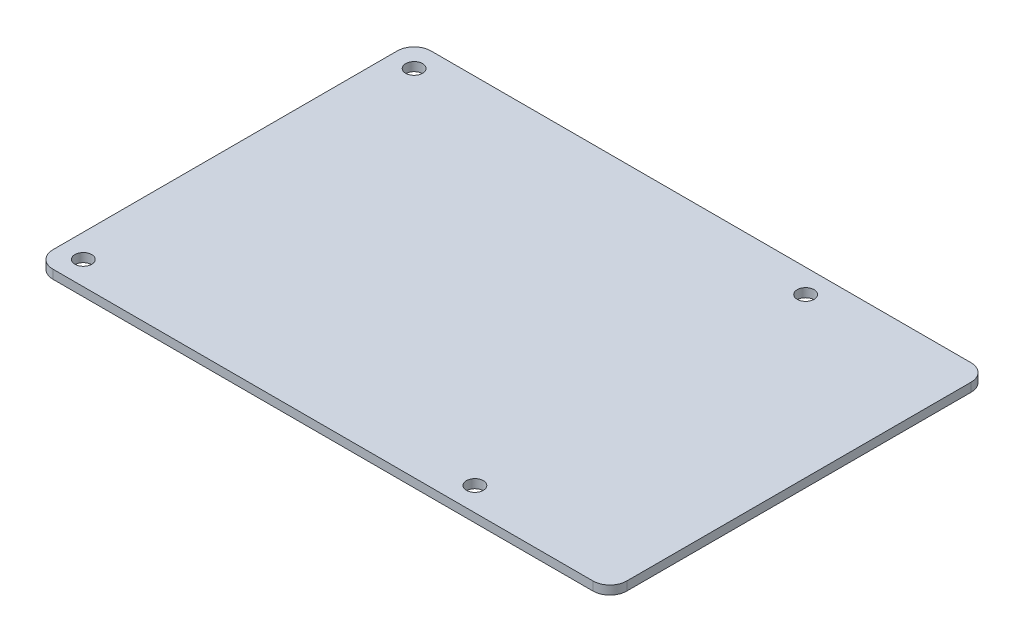
ISO-10303-21;
HEADER;
FILE_DESCRIPTION(('STEP AP214'),'2;1');
FILE_NAME('part.step','',(''),(''),'','','');
FILE_SCHEMA(('AUTOMOTIVE_DESIGN { 1 0 10303 214 1 1 1 1 }'));
ENDSEC;
DATA;
#1=APPLICATION_CONTEXT('core data for automotive mechanical design processes');
#2=APPLICATION_PROTOCOL_DEFINITION('international standard','automotive_design',2000,#1);
#3=PRODUCT_CONTEXT('',#1,'mechanical');
#4=PRODUCT('Part','Part','',(#3));
#5=PRODUCT_RELATED_PRODUCT_CATEGORY('part','',(#4));
#6=PRODUCT_DEFINITION_FORMATION('','',#4);
#7=PRODUCT_DEFINITION_CONTEXT('part definition',#1,'design');
#8=PRODUCT_DEFINITION('design','',#6,#7);
#9=PRODUCT_DEFINITION_SHAPE('','',#8);
#10=(LENGTH_UNIT() NAMED_UNIT(*) SI_UNIT(.MILLI.,.METRE.));
#11=(NAMED_UNIT(*) PLANE_ANGLE_UNIT() SI_UNIT($,.RADIAN.));
#12=(NAMED_UNIT(*) SI_UNIT($,.STERADIAN.) SOLID_ANGLE_UNIT());
#13=UNCERTAINTY_MEASURE_WITH_UNIT(LENGTH_MEASURE(1.E-05),#10,'distance_accuracy_value','');
#14=(GEOMETRIC_REPRESENTATION_CONTEXT(3) GLOBAL_UNCERTAINTY_ASSIGNED_CONTEXT((#13)) GLOBAL_UNIT_ASSIGNED_CONTEXT((#10,
#11,#12)) REPRESENTATION_CONTEXT('',''));
#15=CARTESIAN_POINT('',(0.,0.,0.));
#16=DIRECTION('',(0.,0.,1.));
#17=DIRECTION('',(1.,0.,0.));
#18=AXIS2_PLACEMENT_3D('',#15,#16,#17);
#19=CARTESIAN_POINT('',(39.9999999999725,0.,25.5000000000432));
#20=DIRECTION('',(0.,1.,0.));
#21=DIRECTION('',(0.,0.,1.));
#22=AXIS2_PLACEMENT_3D('',#19,#20,#21);
#23=PLANE('',#22);
#24=CARTESIAN_POINT('',(-40.0000000000275,0.,25.4999999999568));
#25=DIRECTION('',(0.,1.,0.));
#26=DIRECTION('',(0.,0.,1.));
#27=AXIS2_PLACEMENT_3D('',#24,#25,#26);
#28=CIRCLE('',#27,2.50000000000001);
#29=CARTESIAN_POINT('',(-40.0000000000302,0.,27.9999999999568));
#30=VERTEX_POINT('',#29);
#31=CARTESIAN_POINT('',(-42.5000000000275,0.,25.4999999999541));
#32=VERTEX_POINT('',#31);
#33=EDGE_CURVE('E143',#30,#32,#28,.F.);
#34=ORIENTED_EDGE('',*,*,#33,.F.);
#35=DIRECTION('',(1.,0.,1.07938831483967E-12));
#36=VECTOR('',#35,1.);
#37=CARTESIAN_POINT('',(-40.0000000000302,0.,27.9999999999568));
#38=LINE('',#37,#36);
#39=CARTESIAN_POINT('',(39.9999999999711,0.,28.0000000000432));
#40=VERTEX_POINT('',#39);
#41=EDGE_CURVE('E111',#40,#30,#38,.F.);
#42=ORIENTED_EDGE('',*,*,#41,.F.);
#43=CARTESIAN_POINT('',(39.9999999999725,0.,25.5000000000432));
#44=DIRECTION('',(0.,1.,0.));
#45=DIRECTION('',(0.,0.,1.));
#46=AXIS2_PLACEMENT_3D('',#43,#44,#45);
#47=CIRCLE('',#46,2.50000000000001);
#48=CARTESIAN_POINT('',(42.4999999999725,0.,25.5000000000459));
#49=VERTEX_POINT('',#48);
#50=EDGE_CURVE('E97',#49,#40,#47,.F.);
#51=ORIENTED_EDGE('',*,*,#50,.F.);
#52=DIRECTION('',(1.07920208717239E-12,0.,-1.));
#53=VECTOR('',#52,1.);
#54=CARTESIAN_POINT('',(42.4999999999725,0.,25.5000000000459));
#55=LINE('',#54,#53);
#56=CARTESIAN_POINT('',(42.5000000000275,0.,-25.4999999999541));
#57=VERTEX_POINT('',#56);
#58=EDGE_CURVE('E91',#57,#49,#55,.F.);
#59=ORIENTED_EDGE('',*,*,#58,.F.);
#60=CARTESIAN_POINT('',(40.0000000000275,0.,-25.4999999999568));
#61=DIRECTION('',(0.,1.,0.));
#62=DIRECTION('',(0.,0.,1.));
#63=AXIS2_PLACEMENT_3D('',#60,#61,#62);
#64=CIRCLE('',#63,2.5);
#65=CARTESIAN_POINT('',(40.0000000000302,0.,-27.9999999999568));
#66=VERTEX_POINT('',#65);
#67=EDGE_CURVE('E82',#66,#57,#64,.F.);
#68=ORIENTED_EDGE('',*,*,#67,.F.);
#69=DIRECTION('',(-1.,0.,-1.07908473823137E-12));
#70=VECTOR('',#69,1.);
#71=CARTESIAN_POINT('',(40.0000000000302,0.,-27.9999999999568));
#72=LINE('',#71,#70);
#73=CARTESIAN_POINT('',(-39.9999999999698,0.,-28.0000000000432));
#74=VERTEX_POINT('',#73);
#75=EDGE_CURVE('E77',#74,#66,#72,.F.);
#76=ORIENTED_EDGE('',*,*,#75,.F.);
#77=CARTESIAN_POINT('',(-39.9999999999725,0.,-25.5000000000431));
#78=DIRECTION('',(0.,1.,0.));
#79=DIRECTION('',(0.,0.,1.));
#80=AXIS2_PLACEMENT_3D('',#77,#78,#79);
#81=CIRCLE('',#80,2.5);
#82=CARTESIAN_POINT('',(-42.4999999999725,0.,-25.5000000000458));
#83=VERTEX_POINT('',#82);
#84=EDGE_CURVE('E145',#83,#74,#81,.F.);
#85=ORIENTED_EDGE('',*,*,#84,.F.);
#86=DIRECTION('',(-1.07933814391561E-12,0.,1.));
#87=VECTOR('',#86,1.);
#88=CARTESIAN_POINT('',(-42.4999999999725,0.,-25.5000000000458));
#89=LINE('',#88,#87);
#90=EDGE_CURVE('E115',#32,#83,#89,.F.);
#91=ORIENTED_EDGE('',*,*,#90,.F.);
#92=EDGE_LOOP('',(#34,#42,#51,#59,#68,#76,#85,#91));
#93=FACE_BOUND('',#92,.T.);
#94=CARTESIAN_POINT('',(19.000000000013,0.,-24.499999999993));
#95=DIRECTION('',(0.,1.,0.));
#96=DIRECTION('',(0.,0.,1.));
#97=AXIS2_PLACEMENT_3D('',#94,#95,#96);
#98=CIRCLE('',#97,1.24999999998654);
#99=CARTESIAN_POINT('',(19.000000000013,0.,-23.2500000000065));
#100=VERTEX_POINT('',#99);
#101=EDGE_CURVE('E101',#100,#100,#98,.F.);
#102=ORIENTED_EDGE('',*,*,#101,.T.);
#103=EDGE_LOOP('',(#102));
#104=FACE_BOUND('',#103,.T.);
#105=CARTESIAN_POINT('',(-38.999999999987,0.,-24.5000000000555));
#106=DIRECTION('',(0.,1.,0.));
#107=DIRECTION('',(0.,0.,1.));
#108=AXIS2_PLACEMENT_3D('',#105,#106,#107);
#109=CIRCLE('',#108,1.24999999998659);
#110=CARTESIAN_POINT('',(-38.999999999987,0.,-23.250000000069));
#111=VERTEX_POINT('',#110);
#112=EDGE_CURVE('E149',#111,#111,#109,.F.);
#113=ORIENTED_EDGE('',*,*,#112,.T.);
#114=EDGE_LOOP('',(#113));
#115=FACE_BOUND('',#114,.T.);
#116=CARTESIAN_POINT('',(-39.0000000000399,0.,24.4999999999304));
#117=DIRECTION('',(0.,1.,0.));
#118=DIRECTION('',(0.,0.,1.));
#119=AXIS2_PLACEMENT_3D('',#116,#117,#118);
#120=CIRCLE('',#119,1.24999999998655);
#121=CARTESIAN_POINT('',(-39.0000000000399,0.,25.7499999999169));
#122=VERTEX_POINT('',#121);
#123=EDGE_CURVE('E151',#122,#122,#120,.F.);
#124=ORIENTED_EDGE('',*,*,#123,.T.);
#125=EDGE_LOOP('',(#124));
#126=FACE_BOUND('',#125,.T.);
#127=CARTESIAN_POINT('',(18.9999999999601,0.,24.499999999993));
#128=DIRECTION('',(0.,1.,0.));
#129=DIRECTION('',(0.,0.,1.));
#130=AXIS2_PLACEMENT_3D('',#127,#128,#129);
#131=CIRCLE('',#130,1.24999999998654);
#132=CARTESIAN_POINT('',(18.9999999999601,0.,25.7499999999795));
#133=VERTEX_POINT('',#132);
#134=EDGE_CURVE('E19',#133,#133,#131,.F.);
#135=ORIENTED_EDGE('',*,*,#134,.T.);
#136=EDGE_LOOP('',(#135));
#137=FACE_BOUND('',#136,.T.);
#138=ADVANCED_FACE('F16',(#93,#104,#115,#126,#137),#23,.T.);
#139=CARTESIAN_POINT('',(18.9999999999601,-1.3,24.499999999993));
#140=DIRECTION('',(0.,1.,0.));
#141=DIRECTION('',(0.,0.,1.));
#142=AXIS2_PLACEMENT_3D('',#139,#140,#141);
#143=CYLINDRICAL_SURFACE('',#142,1.24999999998654);
#144=CARTESIAN_POINT('',(18.9999999999601,-1.3,24.499999999993));
#145=DIRECTION('',(0.,1.,0.));
#146=DIRECTION('',(0.,0.,1.));
#147=AXIS2_PLACEMENT_3D('',#144,#145,#146);
#148=CIRCLE('',#147,1.24999999998654);
#149=CARTESIAN_POINT('',(18.9999999999601,-1.3,25.7499999999795));
#150=VERTEX_POINT('',#149);
#151=EDGE_CURVE('E138',#150,#150,#148,.F.);
#152=ORIENTED_EDGE('',*,*,#151,.T.);
#153=EDGE_LOOP('',(#152));
#154=FACE_BOUND('',#153,.T.);
#155=ORIENTED_EDGE('',*,*,#134,.F.);
#156=EDGE_LOOP('',(#155));
#157=FACE_BOUND('',#156,.T.);
#158=ADVANCED_FACE('F159',(#154,#157),#143,.F.);
#159=CARTESIAN_POINT('',(-39.0000000000399,-1.3,24.4999999999304));
#160=DIRECTION('',(0.,1.,0.));
#161=DIRECTION('',(0.,0.,1.));
#162=AXIS2_PLACEMENT_3D('',#159,#160,#161);
#163=CYLINDRICAL_SURFACE('',#162,1.24999999998655);
#164=CARTESIAN_POINT('',(-39.0000000000399,-1.3,24.4999999999304));
#165=DIRECTION('',(0.,1.,0.));
#166=DIRECTION('',(0.,0.,1.));
#167=AXIS2_PLACEMENT_3D('',#164,#165,#166);
#168=CIRCLE('',#167,1.24999999998655);
#169=CARTESIAN_POINT('',(-39.0000000000399,-1.3,25.7499999999169));
#170=VERTEX_POINT('',#169);
#171=EDGE_CURVE('E135',#170,#170,#168,.F.);
#172=ORIENTED_EDGE('',*,*,#171,.T.);
#173=EDGE_LOOP('',(#172));
#174=FACE_BOUND('',#173,.T.);
#175=ORIENTED_EDGE('',*,*,#123,.F.);
#176=EDGE_LOOP('',(#175));
#177=FACE_BOUND('',#176,.T.);
#178=ADVANCED_FACE('F161',(#174,#177),#163,.F.);
#179=CARTESIAN_POINT('',(-38.999999999987,-1.3,-24.5000000000555));
#180=DIRECTION('',(0.,1.,0.));
#181=DIRECTION('',(0.,0.,1.));
#182=AXIS2_PLACEMENT_3D('',#179,#180,#181);
#183=CYLINDRICAL_SURFACE('',#182,1.24999999998659);
#184=CARTESIAN_POINT('',(-38.999999999987,-1.3,-24.5000000000555));
#185=DIRECTION('',(0.,1.,0.));
#186=DIRECTION('',(0.,0.,1.));
#187=AXIS2_PLACEMENT_3D('',#184,#185,#186);
#188=CIRCLE('',#187,1.24999999998659);
#189=CARTESIAN_POINT('',(-38.999999999987,-1.3,-23.250000000069));
#190=VERTEX_POINT('',#189);
#191=EDGE_CURVE('E132',#190,#190,#188,.F.);
#192=ORIENTED_EDGE('',*,*,#191,.T.);
#193=EDGE_LOOP('',(#192));
#194=FACE_BOUND('',#193,.T.);
#195=ORIENTED_EDGE('',*,*,#112,.F.);
#196=EDGE_LOOP('',(#195));
#197=FACE_BOUND('',#196,.T.);
#198=ADVANCED_FACE('F169',(#194,#197),#183,.F.);
#199=CARTESIAN_POINT('',(19.000000000013,-1.3,-24.499999999993));
#200=DIRECTION('',(0.,1.,0.));
#201=DIRECTION('',(0.,0.,1.));
#202=AXIS2_PLACEMENT_3D('',#199,#200,#201);
#203=CYLINDRICAL_SURFACE('',#202,1.24999999998654);
#204=CARTESIAN_POINT('',(19.000000000013,-1.3,-24.499999999993));
#205=DIRECTION('',(0.,1.,0.));
#206=DIRECTION('',(0.,0.,1.));
#207=AXIS2_PLACEMENT_3D('',#204,#205,#206);
#208=CIRCLE('',#207,1.24999999998654);
#209=CARTESIAN_POINT('',(19.000000000013,-1.3,-23.2500000000065));
#210=VERTEX_POINT('',#209);
#211=EDGE_CURVE('E129',#210,#210,#208,.F.);
#212=ORIENTED_EDGE('',*,*,#211,.T.);
#213=EDGE_LOOP('',(#212));
#214=FACE_BOUND('',#213,.T.);
#215=ORIENTED_EDGE('',*,*,#101,.F.);
#216=EDGE_LOOP('',(#215));
#217=FACE_BOUND('',#216,.T.);
#218=ADVANCED_FACE('F208',(#214,#217),#203,.F.);
#219=CARTESIAN_POINT('',(42.4999999999725,-1.3,25.5000000000459));
#220=DIRECTION('',(1.,0.,1.07920208717239E-12));
#221=DIRECTION('',(1.07920208717239E-12,0.,-1.));
#222=AXIS2_PLACEMENT_3D('',#219,#220,#221);
#223=PLANE('',#222);
#224=DIRECTION('',(0.,0.,1.));
#225=VECTOR('',#224,1.);
#226=CARTESIAN_POINT('',(42.4999999999725,-1.3,25.5000000000432));
#227=LINE('',#226,#225);
#228=CARTESIAN_POINT('',(42.4999999999725,-1.3,25.5000000000445));
#229=VERTEX_POINT('',#228);
#230=CARTESIAN_POINT('',(42.5,-1.3,-25.4999999999555));
#231=VERTEX_POINT('',#230);
#232=EDGE_CURVE('E105',#229,#231,#227,.F.);
#233=ORIENTED_EDGE('',*,*,#232,.T.);
#234=DIRECTION('',(0.,1.,0.));
#235=VECTOR('',#234,1.);
#236=CARTESIAN_POINT('',(42.5000000000275,-1.3,-25.4999999999541));
#237=LINE('',#236,#235);
#238=EDGE_CURVE('E87',#57,#231,#237,.F.);
#239=ORIENTED_EDGE('',*,*,#238,.F.);
#240=ORIENTED_EDGE('',*,*,#58,.T.);
#241=DIRECTION('',(0.,1.,0.));
#242=VECTOR('',#241,1.);
#243=CARTESIAN_POINT('',(42.4999999999725,-1.3,25.5000000000459));
#244=LINE('',#243,#242);
#245=EDGE_CURVE('E141',#229,#49,#244,.T.);
#246=ORIENTED_EDGE('',*,*,#245,.F.);
#247=EDGE_LOOP('',(#233,#239,#240,#246));
#248=FACE_BOUND('',#247,.T.);
#249=ADVANCED_FACE('F104',(#248),#223,.T.);
#250=CARTESIAN_POINT('',(40.0000000000275,-1.3,-25.4999999999568));
#251=DIRECTION('',(0.,1.,0.));
#252=DIRECTION('',(0.,0.,1.));
#253=AXIS2_PLACEMENT_3D('',#250,#251,#252);
#254=CYLINDRICAL_SURFACE('',#253,2.5);
#255=CARTESIAN_POINT('',(40.0000000000275,-1.3,-25.4999999999568));
#256=DIRECTION('',(0.,1.,0.));
#257=DIRECTION('',(0.,0.,1.));
#258=AXIS2_PLACEMENT_3D('',#255,#256,#257);
#259=CIRCLE('',#258,2.5);
#260=CARTESIAN_POINT('',(40.0000000000289,-1.3,-27.9999999999568));
#261=VERTEX_POINT('',#260);
#262=EDGE_CURVE('E127',#231,#261,#259,.T.);
#263=ORIENTED_EDGE('',*,*,#262,.T.);
#264=DIRECTION('',(0.,1.,0.));
#265=VECTOR('',#264,1.);
#266=CARTESIAN_POINT('',(40.0000000000302,-1.3,-27.9999999999568));
#267=LINE('',#266,#265);
#268=EDGE_CURVE('E89',#66,#261,#267,.F.);
#269=ORIENTED_EDGE('',*,*,#268,.F.);
#270=ORIENTED_EDGE('',*,*,#67,.T.);
#271=ORIENTED_EDGE('',*,*,#238,.T.);
#272=EDGE_LOOP('',(#263,#269,#270,#271));
#273=FACE_BOUND('',#272,.T.);
#274=ADVANCED_FACE('F85',(#273),#254,.T.);
#275=CARTESIAN_POINT('',(40.0000000000302,-1.3,-27.9999999999568));
#276=DIRECTION('',(1.07908473823137E-12,0.,-1.));
#277=DIRECTION('',(-1.,0.,-1.07908473823137E-12));
#278=AXIS2_PLACEMENT_3D('',#275,#276,#277);
#279=PLANE('',#278);
#280=DIRECTION('',(1.,0.,0.));
#281=VECTOR('',#280,1.);
#282=CARTESIAN_POINT('',(39.9999999999725,-1.3,-27.9999999999568));
#283=LINE('',#282,#281);
#284=CARTESIAN_POINT('',(-39.9999999999711,-1.3,-28.));
#285=VERTEX_POINT('',#284);
#286=EDGE_CURVE('E126',#261,#285,#283,.F.);
#287=ORIENTED_EDGE('',*,*,#286,.T.);
#288=DIRECTION('',(0.,1.,0.));
#289=VECTOR('',#288,1.);
#290=CARTESIAN_POINT('',(-39.9999999999698,-1.3,-28.0000000000432));
#291=LINE('',#290,#289);
#292=EDGE_CURVE('E117',#74,#285,#291,.F.);
#293=ORIENTED_EDGE('',*,*,#292,.F.);
#294=ORIENTED_EDGE('',*,*,#75,.T.);
#295=ORIENTED_EDGE('',*,*,#268,.T.);
#296=EDGE_LOOP('',(#287,#293,#294,#295));
#297=FACE_BOUND('',#296,.T.);
#298=ADVANCED_FACE('F200',(#297),#279,.T.);
#299=CARTESIAN_POINT('',(-39.9999999999725,-1.3,-25.5000000000431));
#300=DIRECTION('',(0.,1.,0.));
#301=DIRECTION('',(0.,0.,1.));
#302=AXIS2_PLACEMENT_3D('',#299,#300,#301);
#303=CYLINDRICAL_SURFACE('',#302,2.5);
#304=CARTESIAN_POINT('',(-39.9999999999725,-1.3,-25.5000000000431));
#305=DIRECTION('',(0.,1.,0.));
#306=DIRECTION('',(0.,0.,1.));
#307=AXIS2_PLACEMENT_3D('',#304,#305,#306);
#308=CIRCLE('',#307,2.5);
#309=CARTESIAN_POINT('',(-42.4999999999725,-1.3,-25.5000000000445));
#310=VERTEX_POINT('',#309);
#311=EDGE_CURVE('E123',#285,#310,#308,.T.);
#312=ORIENTED_EDGE('',*,*,#311,.T.);
#313=DIRECTION('',(0.,1.,0.));
#314=VECTOR('',#313,1.);
#315=CARTESIAN_POINT('',(-42.4999999999725,-1.3,-25.5000000000458));
#316=LINE('',#315,#314);
#317=EDGE_CURVE('E116',#83,#310,#316,.F.);
#318=ORIENTED_EDGE('',*,*,#317,.F.);
#319=ORIENTED_EDGE('',*,*,#84,.T.);
#320=ORIENTED_EDGE('',*,*,#292,.T.);
#321=EDGE_LOOP('',(#312,#318,#319,#320));
#322=FACE_BOUND('',#321,.T.);
#323=ADVANCED_FACE('F196',(#322),#303,.T.);
#324=CARTESIAN_POINT('',(-42.4999999999725,-1.3,-25.5000000000458));
#325=DIRECTION('',(-1.,0.,-1.07933814391561E-12));
#326=DIRECTION('',(-1.07933814391561E-12,0.,1.));
#327=AXIS2_PLACEMENT_3D('',#324,#325,#326);
#328=PLANE('',#327);
#329=DIRECTION('',(0.,0.,1.));
#330=VECTOR('',#329,1.);
#331=CARTESIAN_POINT('',(-42.4999999999725,-1.3,25.5000000000432));
#332=LINE('',#331,#330);
#333=CARTESIAN_POINT('',(-42.5,-1.3,25.4999999999555));
#334=VERTEX_POINT('',#333);
#335=EDGE_CURVE('E122',#310,#334,#332,.T.);
#336=ORIENTED_EDGE('',*,*,#335,.T.);
#337=DIRECTION('',(0.,1.,0.));
#338=VECTOR('',#337,1.);
#339=CARTESIAN_POINT('',(-42.5000000000275,-1.3,25.4999999999541));
#340=LINE('',#339,#338);
#341=EDGE_CURVE('E114',#32,#334,#340,.F.);
#342=ORIENTED_EDGE('',*,*,#341,.F.);
#343=ORIENTED_EDGE('',*,*,#90,.T.);
#344=ORIENTED_EDGE('',*,*,#317,.T.);
#345=EDGE_LOOP('',(#336,#342,#343,#344));
#346=FACE_BOUND('',#345,.T.);
#347=ADVANCED_FACE('F192',(#346),#328,.T.);
#348=CARTESIAN_POINT('',(-40.0000000000275,-1.3,25.4999999999568));
#349=DIRECTION('',(0.,1.,0.));
#350=DIRECTION('',(0.,0.,1.));
#351=AXIS2_PLACEMENT_3D('',#348,#349,#350);
#352=CYLINDRICAL_SURFACE('',#351,2.50000000000001);
#353=CARTESIAN_POINT('',(-40.0000000000275,-1.3,25.4999999999568));
#354=DIRECTION('',(0.,1.,0.));
#355=DIRECTION('',(0.,0.,1.));
#356=AXIS2_PLACEMENT_3D('',#353,#354,#355);
#357=CIRCLE('',#356,2.50000000000001);
#358=CARTESIAN_POINT('',(-40.0000000000289,-1.3,27.9999999999568));
#359=VERTEX_POINT('',#358);
#360=EDGE_CURVE('E119',#334,#359,#357,.T.);
#361=ORIENTED_EDGE('',*,*,#360,.T.);
#362=DIRECTION('',(0.,1.,0.));
#363=VECTOR('',#362,1.);
#364=CARTESIAN_POINT('',(-40.0000000000302,-1.3,27.9999999999568));
#365=LINE('',#364,#363);
#366=EDGE_CURVE('E113',#30,#359,#365,.F.);
#367=ORIENTED_EDGE('',*,*,#366,.F.);
#368=ORIENTED_EDGE('',*,*,#33,.T.);
#369=ORIENTED_EDGE('',*,*,#341,.T.);
#370=EDGE_LOOP('',(#361,#367,#368,#369));
#371=FACE_BOUND('',#370,.T.);
#372=ADVANCED_FACE('F188',(#371),#352,.T.);
#373=CARTESIAN_POINT('',(-40.0000000000302,-1.3,27.9999999999568));
#374=DIRECTION('',(-1.07938831483967E-12,0.,1.));
#375=DIRECTION('',(1.,0.,1.07938831483967E-12));
#376=AXIS2_PLACEMENT_3D('',#373,#374,#375);
#377=PLANE('',#376);
#378=DIRECTION('',(1.,0.,0.));
#379=VECTOR('',#378,1.);
#380=CARTESIAN_POINT('',(39.9999999999725,-1.3,27.9999999999568));
#381=LINE('',#380,#379);
#382=CARTESIAN_POINT('',(39.9999999999725,-1.3,28.));
#383=VERTEX_POINT('',#382);
#384=EDGE_CURVE('E25',#359,#383,#381,.T.);
#385=ORIENTED_EDGE('',*,*,#384,.T.);
#386=DIRECTION('',(0.,1.,0.));
#387=VECTOR('',#386,1.);
#388=CARTESIAN_POINT('',(39.9999999999725,-1.3,28.0000000000432));
#389=LINE('',#388,#387);
#390=EDGE_CURVE('E33',#40,#383,#389,.F.);
#391=ORIENTED_EDGE('',*,*,#390,.F.);
#392=ORIENTED_EDGE('',*,*,#41,.T.);
#393=ORIENTED_EDGE('',*,*,#366,.T.);
#394=EDGE_LOOP('',(#385,#391,#392,#393));
#395=FACE_BOUND('',#394,.T.);
#396=ADVANCED_FACE('F181',(#395),#377,.T.);
#397=CARTESIAN_POINT('',(39.9999999999725,-1.3,25.5000000000432));
#398=DIRECTION('',(0.,1.,0.));
#399=DIRECTION('',(0.,0.,1.));
#400=AXIS2_PLACEMENT_3D('',#397,#398,#399);
#401=CYLINDRICAL_SURFACE('',#400,2.50000000000001);
#402=CARTESIAN_POINT('',(39.9999999999725,-1.3,25.5000000000432));
#403=DIRECTION('',(0.,1.,0.));
#404=DIRECTION('',(0.,0.,1.));
#405=AXIS2_PLACEMENT_3D('',#402,#403,#404);
#406=CIRCLE('',#405,2.50000000000001);
#407=EDGE_CURVE('E11',#383,#229,#406,.T.);
#408=ORIENTED_EDGE('',*,*,#407,.T.);
#409=ORIENTED_EDGE('',*,*,#245,.T.);
#410=ORIENTED_EDGE('',*,*,#50,.T.);
#411=ORIENTED_EDGE('',*,*,#390,.T.);
#412=EDGE_LOOP('',(#408,#409,#410,#411));
#413=FACE_BOUND('',#412,.T.);
#414=ADVANCED_FACE('F174',(#413),#401,.T.);
#415=CARTESIAN_POINT('',(39.9999999999725,-1.3,25.5000000000432));
#416=DIRECTION('',(0.,1.,0.));
#417=DIRECTION('',(0.,0.,1.));
#418=AXIS2_PLACEMENT_3D('',#415,#416,#417);
#419=PLANE('',#418);
#420=ORIENTED_EDGE('',*,*,#384,.F.);
#421=ORIENTED_EDGE('',*,*,#360,.F.);
#422=ORIENTED_EDGE('',*,*,#335,.F.);
#423=ORIENTED_EDGE('',*,*,#311,.F.);
#424=ORIENTED_EDGE('',*,*,#286,.F.);
#425=ORIENTED_EDGE('',*,*,#262,.F.);
#426=ORIENTED_EDGE('',*,*,#232,.F.);
#427=ORIENTED_EDGE('',*,*,#407,.F.);
#428=EDGE_LOOP('',(#420,#421,#422,#423,#424,#425,#426,#427));
#429=FACE_BOUND('',#428,.T.);
#430=ORIENTED_EDGE('',*,*,#211,.F.);
#431=EDGE_LOOP('',(#430));
#432=FACE_BOUND('',#431,.T.);
#433=ORIENTED_EDGE('',*,*,#191,.F.);
#434=EDGE_LOOP('',(#433));
#435=FACE_BOUND('',#434,.T.);
#436=ORIENTED_EDGE('',*,*,#171,.F.);
#437=EDGE_LOOP('',(#436));
#438=FACE_BOUND('',#437,.T.);
#439=ORIENTED_EDGE('',*,*,#151,.F.);
#440=EDGE_LOOP('',(#439));
#441=FACE_BOUND('',#440,.T.);
#442=ADVANCED_FACE('F172',(#429,#432,#435,#438,#441),#419,.F.);
#443=CLOSED_SHELL('',(#138,#158,#178,#198,#218,#249,#274,#298,#323,#347,#372,#396,#414,#442));
#444=MANIFOLD_SOLID_BREP('B1',#443);
#445=ADVANCED_BREP_SHAPE_REPRESENTATION('',(#18,#444),#14);
#446=SHAPE_DEFINITION_REPRESENTATION(#9,#445);
ENDSEC;
END-ISO-10303-21;
